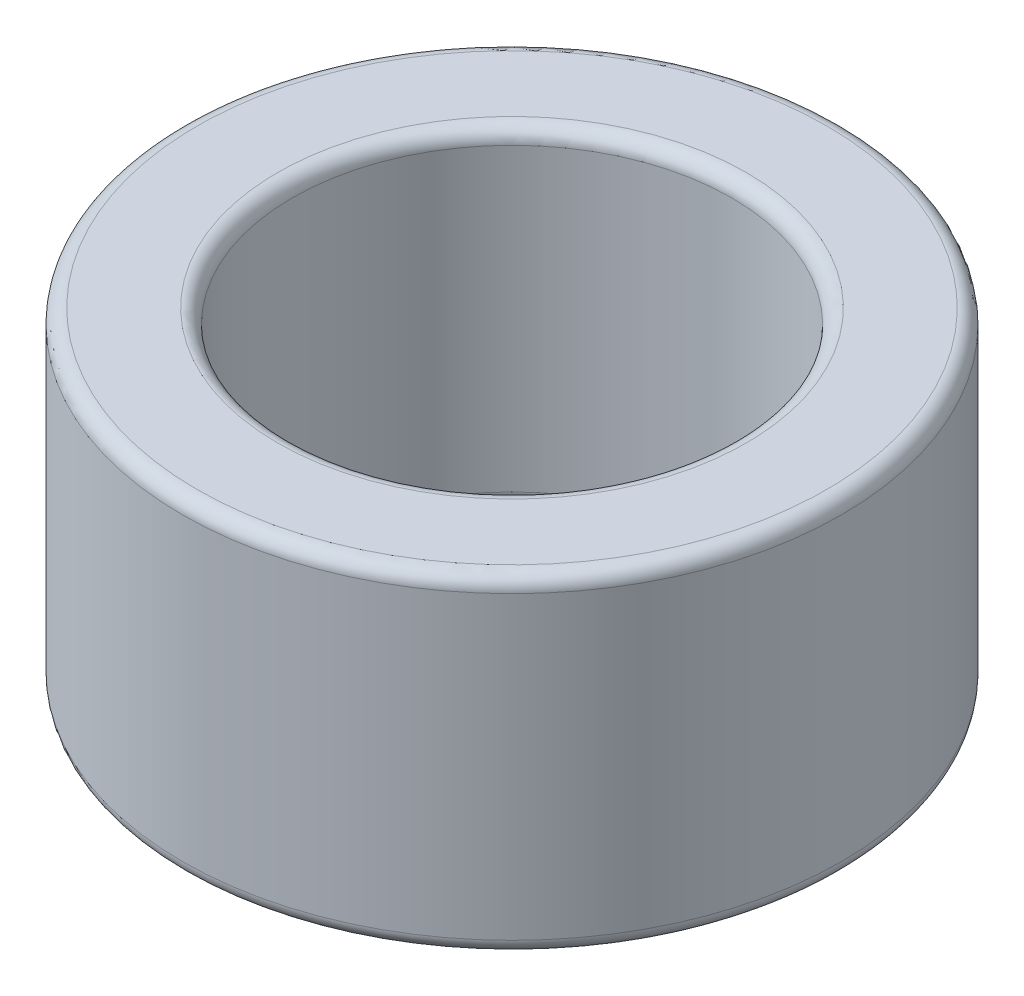
ISO-10303-21;
HEADER;
FILE_DESCRIPTION(('STEP AP214'),'2;1');
FILE_NAME('part.step','',(''),(''),'','','');
FILE_SCHEMA(('AUTOMOTIVE_DESIGN { 1 0 10303 214 1 1 1 1 }'));
ENDSEC;
DATA;
#1=APPLICATION_CONTEXT('core data for automotive mechanical design processes');
#2=APPLICATION_PROTOCOL_DEFINITION('international standard','automotive_design',2000,#1);
#3=PRODUCT_CONTEXT('',#1,'mechanical');
#4=PRODUCT('Part','Part','',(#3));
#5=PRODUCT_RELATED_PRODUCT_CATEGORY('part','',(#4));
#6=PRODUCT_DEFINITION_FORMATION('','',#4);
#7=PRODUCT_DEFINITION_CONTEXT('part definition',#1,'design');
#8=PRODUCT_DEFINITION('design','',#6,#7);
#9=PRODUCT_DEFINITION_SHAPE('','',#8);
#10=(LENGTH_UNIT() NAMED_UNIT(*) SI_UNIT(.MILLI.,.METRE.));
#11=(NAMED_UNIT(*) PLANE_ANGLE_UNIT() SI_UNIT($,.RADIAN.));
#12=(NAMED_UNIT(*) SI_UNIT($,.STERADIAN.) SOLID_ANGLE_UNIT());
#13=UNCERTAINTY_MEASURE_WITH_UNIT(LENGTH_MEASURE(1.E-05),#10,'distance_accuracy_value','');
#14=(GEOMETRIC_REPRESENTATION_CONTEXT(3) GLOBAL_UNCERTAINTY_ASSIGNED_CONTEXT((#13)) GLOBAL_UNIT_ASSIGNED_CONTEXT((#10,
#11,#12)) REPRESENTATION_CONTEXT('',''));
#15=CARTESIAN_POINT('',(0.,0.,0.));
#16=DIRECTION('',(0.,0.,1.));
#17=DIRECTION('',(1.,0.,0.));
#18=AXIS2_PLACEMENT_3D('',#15,#16,#17);
#19=CARTESIAN_POINT('',(0.,22.5,0.));
#20=DIRECTION('',(0.,1.,0.));
#21=DIRECTION('',(0.,0.,1.));
#22=AXIS2_PLACEMENT_3D('',#19,#20,#21);
#23=PLANE('',#22);
#24=CARTESIAN_POINT('',(0.,22.5,0.));
#25=DIRECTION('',(0.,1.,0.));
#26=DIRECTION('',(0.,0.,1.));
#27=AXIS2_PLACEMENT_3D('',#24,#25,#26);
#28=CIRCLE('',#27,16.);
#29=CARTESIAN_POINT('',(0.,22.5,16.));
#30=VERTEX_POINT('',#29);
#31=EDGE_CURVE('E61',#30,#30,#28,.F.);
#32=ORIENTED_EDGE('',*,*,#31,.T.);
#33=EDGE_LOOP('',(#32));
#34=FACE_BOUND('',#33,.T.);
#35=CARTESIAN_POINT('',(0.,22.5,0.));
#36=DIRECTION('',(0.,1.,0.));
#37=DIRECTION('',(0.,0.,1.));
#38=AXIS2_PLACEMENT_3D('',#35,#36,#37);
#39=CIRCLE('',#38,21.5);
#40=CARTESIAN_POINT('',(0.,22.5,21.5));
#41=VERTEX_POINT('',#40);
#42=EDGE_CURVE('E79',#41,#41,#39,.T.);
#43=ORIENTED_EDGE('',*,*,#42,.T.);
#44=EDGE_LOOP('',(#43));
#45=FACE_BOUND('',#44,.T.);
#46=ADVANCED_FACE('F43',(#34,#45),#23,.T.);
#47=CARTESIAN_POINT('',(0.,0.,0.));
#48=DIRECTION('',(0.,1.,0.));
#49=DIRECTION('',(0.,0.,1.));
#50=AXIS2_PLACEMENT_3D('',#47,#48,#49);
#51=PLANE('',#50);
#52=CARTESIAN_POINT('',(0.,0.,0.));
#53=DIRECTION('',(0.,1.,0.));
#54=DIRECTION('',(0.,0.,1.));
#55=AXIS2_PLACEMENT_3D('',#52,#53,#54);
#56=CIRCLE('',#55,16.);
#57=CARTESIAN_POINT('',(0.,0.,16.));
#58=VERTEX_POINT('',#57);
#59=EDGE_CURVE('E51',#58,#58,#56,.T.);
#60=ORIENTED_EDGE('',*,*,#59,.T.);
#61=EDGE_LOOP('',(#60));
#62=FACE_BOUND('',#61,.T.);
#63=CARTESIAN_POINT('',(0.,0.,0.));
#64=DIRECTION('',(0.,1.,0.));
#65=DIRECTION('',(0.,0.,1.));
#66=AXIS2_PLACEMENT_3D('',#63,#64,#65);
#67=CIRCLE('',#66,21.5);
#68=CARTESIAN_POINT('',(0.,0.,21.5));
#69=VERTEX_POINT('',#68);
#70=EDGE_CURVE('E56',#69,#69,#67,.F.);
#71=ORIENTED_EDGE('',*,*,#70,.T.);
#72=EDGE_LOOP('',(#71));
#73=FACE_BOUND('',#72,.T.);
#74=ADVANCED_FACE('F104',(#62,#73),#51,.F.);
#75=CARTESIAN_POINT('',(0.,22.5,0.));
#76=DIRECTION('',(0.,-1.,0.));
#77=DIRECTION('',(0.,0.,-1.));
#78=AXIS2_PLACEMENT_3D('',#75,#76,#77);
#79=CYLINDRICAL_SURFACE('',#78,22.5);
#80=CARTESIAN_POINT('',(0.,1.,0.));
#81=DIRECTION('',(0.,1.,0.));
#82=DIRECTION('',(0.,0.,1.));
#83=AXIS2_PLACEMENT_3D('',#80,#81,#82);
#84=CIRCLE('',#83,22.5);
#85=CARTESIAN_POINT('',(0.,1.,22.5));
#86=VERTEX_POINT('',#85);
#87=EDGE_CURVE('E10',#86,#86,#84,.T.);
#88=ORIENTED_EDGE('',*,*,#87,.T.);
#89=EDGE_LOOP('',(#88));
#90=FACE_BOUND('',#89,.T.);
#91=CARTESIAN_POINT('',(0.,21.5,0.));
#92=DIRECTION('',(0.,1.,0.));
#93=DIRECTION('',(0.,0.,1.));
#94=AXIS2_PLACEMENT_3D('',#91,#92,#93);
#95=CIRCLE('',#94,22.5);
#96=CARTESIAN_POINT('',(0.,21.5,22.5));
#97=VERTEX_POINT('',#96);
#98=EDGE_CURVE('E75',#97,#97,#95,.F.);
#99=ORIENTED_EDGE('',*,*,#98,.T.);
#100=EDGE_LOOP('',(#99));
#101=FACE_BOUND('',#100,.T.);
#102=ADVANCED_FACE('F99',(#90,#101),#79,.T.);
#103=CARTESIAN_POINT('',(0.,22.5,0.));
#104=DIRECTION('',(0.,-1.,0.));
#105=DIRECTION('',(0.,0.,-1.));
#106=AXIS2_PLACEMENT_3D('',#103,#104,#105);
#107=CYLINDRICAL_SURFACE('',#106,15.);
#108=CARTESIAN_POINT('',(0.,21.5,0.));
#109=DIRECTION('',(0.,1.,0.));
#110=DIRECTION('',(0.,0.,1.));
#111=AXIS2_PLACEMENT_3D('',#108,#109,#110);
#112=CIRCLE('',#111,15.);
#113=CARTESIAN_POINT('',(0.,21.5,15.));
#114=VERTEX_POINT('',#113);
#115=EDGE_CURVE('E67',#114,#114,#112,.T.);
#116=ORIENTED_EDGE('',*,*,#115,.T.);
#117=EDGE_LOOP('',(#116));
#118=FACE_BOUND('',#117,.T.);
#119=CARTESIAN_POINT('',(0.,1.,0.));
#120=DIRECTION('',(0.,1.,0.));
#121=DIRECTION('',(0.,0.,1.));
#122=AXIS2_PLACEMENT_3D('',#119,#120,#121);
#123=CIRCLE('',#122,15.);
#124=CARTESIAN_POINT('',(0.,1.,15.));
#125=VERTEX_POINT('',#124);
#126=EDGE_CURVE('E71',#125,#125,#123,.F.);
#127=ORIENTED_EDGE('',*,*,#126,.T.);
#128=EDGE_LOOP('',(#127));
#129=FACE_BOUND('',#128,.T.);
#130=ADVANCED_FACE('F88',(#118,#129),#107,.F.);
#131=CARTESIAN_POINT('',(0.,21.5,0.));
#132=DIRECTION('',(0.,1.,0.));
#133=DIRECTION('',(0.,0.,1.));
#134=AXIS2_PLACEMENT_3D('',#131,#132,#133);
#135=TOROIDAL_SURFACE('',#134,21.5,1.);
#136=ORIENTED_EDGE('',*,*,#98,.F.);
#137=EDGE_LOOP('',(#136));
#138=FACE_BOUND('',#137,.T.);
#139=ORIENTED_EDGE('',*,*,#42,.F.);
#140=EDGE_LOOP('',(#139));
#141=FACE_BOUND('',#140,.T.);
#142=ADVANCED_FACE('F85',(#138,#141),#135,.T.);
#143=CARTESIAN_POINT('',(0.,21.5,0.));
#144=DIRECTION('',(0.,1.,0.));
#145=DIRECTION('',(0.,0.,1.));
#146=AXIS2_PLACEMENT_3D('',#143,#144,#145);
#147=TOROIDAL_SURFACE('',#146,16.,1.);
#148=ORIENTED_EDGE('',*,*,#31,.F.);
#149=EDGE_LOOP('',(#148));
#150=FACE_BOUND('',#149,.T.);
#151=ORIENTED_EDGE('',*,*,#115,.F.);
#152=EDGE_LOOP('',(#151));
#153=FACE_BOUND('',#152,.T.);
#154=ADVANCED_FACE('F87',(#150,#153),#147,.T.);
#155=CARTESIAN_POINT('',(0.,1.,0.));
#156=DIRECTION('',(0.,1.,0.));
#157=DIRECTION('',(0.,0.,1.));
#158=AXIS2_PLACEMENT_3D('',#155,#156,#157);
#159=TOROIDAL_SURFACE('',#158,16.,1.);
#160=ORIENTED_EDGE('',*,*,#126,.F.);
#161=EDGE_LOOP('',(#160));
#162=FACE_BOUND('',#161,.T.);
#163=ORIENTED_EDGE('',*,*,#59,.F.);
#164=EDGE_LOOP('',(#163));
#165=FACE_BOUND('',#164,.T.);
#166=ADVANCED_FACE('F95',(#162,#165),#159,.T.);
#167=CARTESIAN_POINT('',(0.,1.,0.));
#168=DIRECTION('',(0.,1.,0.));
#169=DIRECTION('',(0.,0.,1.));
#170=AXIS2_PLACEMENT_3D('',#167,#168,#169);
#171=TOROIDAL_SURFACE('',#170,21.5,1.);
#172=ORIENTED_EDGE('',*,*,#70,.F.);
#173=EDGE_LOOP('',(#172));
#174=FACE_BOUND('',#173,.T.);
#175=ORIENTED_EDGE('',*,*,#87,.F.);
#176=EDGE_LOOP('',(#175));
#177=FACE_BOUND('',#176,.T.);
#178=ADVANCED_FACE('F45',(#174,#177),#171,.T.);
#179=CLOSED_SHELL('',(#46,#74,#102,#130,#142,#154,#166,#178));
#180=MANIFOLD_SOLID_BREP('B2',#179);
#181=ADVANCED_BREP_SHAPE_REPRESENTATION('',(#18,#180),#14);
#182=SHAPE_DEFINITION_REPRESENTATION(#9,#181);
ENDSEC;
END-ISO-10303-21;
